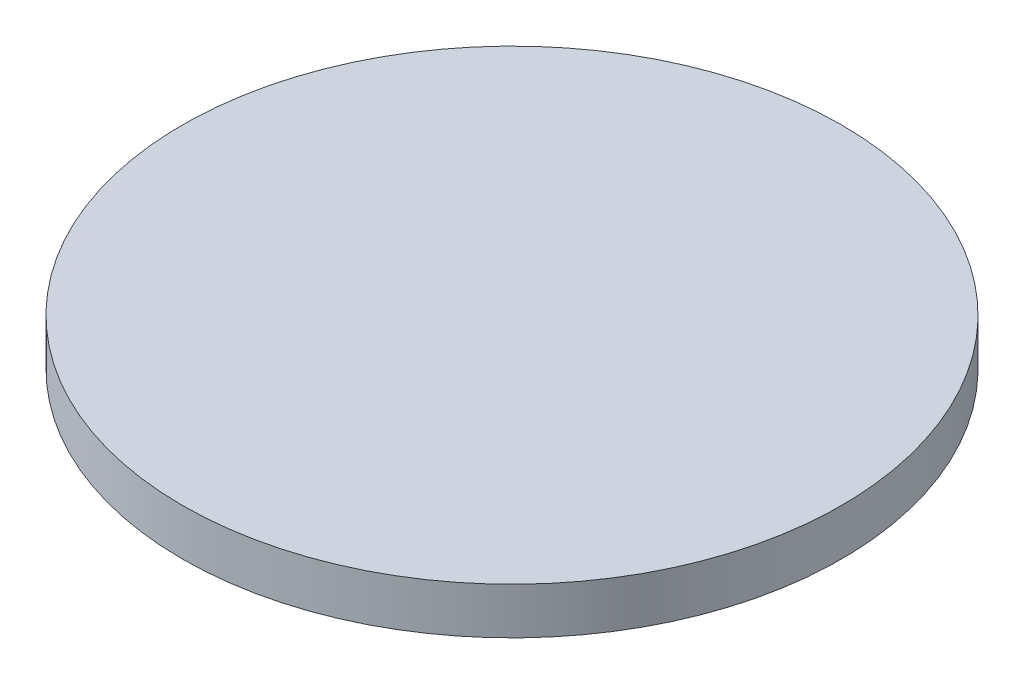
ISO-10303-21;
HEADER;
FILE_DESCRIPTION(('STEP AP214'),'2;1');
FILE_NAME('part.step','',(''),(''),'','','');
FILE_SCHEMA(('AUTOMOTIVE_DESIGN { 1 0 10303 214 1 1 1 1 }'));
ENDSEC;
DATA;
#1=APPLICATION_CONTEXT('core data for automotive mechanical design processes');
#2=APPLICATION_PROTOCOL_DEFINITION('international standard','automotive_design',2000,#1);
#3=PRODUCT_CONTEXT('',#1,'mechanical');
#4=PRODUCT('Part','Part','',(#3));
#5=PRODUCT_RELATED_PRODUCT_CATEGORY('part','',(#4));
#6=PRODUCT_DEFINITION_FORMATION('','',#4);
#7=PRODUCT_DEFINITION_CONTEXT('part definition',#1,'design');
#8=PRODUCT_DEFINITION('design','',#6,#7);
#9=PRODUCT_DEFINITION_SHAPE('','',#8);
#10=(LENGTH_UNIT() NAMED_UNIT(*) SI_UNIT(.MILLI.,.METRE.));
#11=(NAMED_UNIT(*) PLANE_ANGLE_UNIT() SI_UNIT($,.RADIAN.));
#12=(NAMED_UNIT(*) SI_UNIT($,.STERADIAN.) SOLID_ANGLE_UNIT());
#13=UNCERTAINTY_MEASURE_WITH_UNIT(LENGTH_MEASURE(1.E-05),#10,'distance_accuracy_value','');
#14=(GEOMETRIC_REPRESENTATION_CONTEXT(3) GLOBAL_UNCERTAINTY_ASSIGNED_CONTEXT((#13)) GLOBAL_UNIT_ASSIGNED_CONTEXT((#10,
#11,#12)) REPRESENTATION_CONTEXT('',''));
#15=CARTESIAN_POINT('',(0.,0.,0.));
#16=DIRECTION('',(0.,0.,1.));
#17=DIRECTION('',(1.,0.,0.));
#18=AXIS2_PLACEMENT_3D('',#15,#16,#17);
#19=CARTESIAN_POINT('',(0.,16.,0.));
#20=DIRECTION('',(0.,-1.,0.));
#21=DIRECTION('',(0.,0.,-1.));
#22=AXIS2_PLACEMENT_3D('',#19,#20,#21);
#23=CYLINDRICAL_SURFACE('',#22,113.5);
#24=CARTESIAN_POINT('',(0.,16.,0.));
#25=DIRECTION('',(0.,1.,0.));
#26=DIRECTION('',(0.,0.,1.));
#27=AXIS2_PLACEMENT_3D('',#24,#25,#26);
#28=CIRCLE('',#27,113.5);
#29=CARTESIAN_POINT('',(0.,16.,113.5));
#30=VERTEX_POINT('',#29);
#31=EDGE_CURVE('E10',#30,#30,#28,.T.);
#32=ORIENTED_EDGE('',*,*,#31,.F.);
#33=EDGE_LOOP('',(#32));
#34=FACE_BOUND('',#33,.T.);
#35=CARTESIAN_POINT('',(0.,0.,0.));
#36=DIRECTION('',(0.,1.,0.));
#37=DIRECTION('',(0.,0.,1.));
#38=AXIS2_PLACEMENT_3D('',#35,#36,#37);
#39=CIRCLE('',#38,113.5);
#40=CARTESIAN_POINT('',(0.,0.,113.5));
#41=VERTEX_POINT('',#40);
#42=EDGE_CURVE('E40',#41,#41,#39,.T.);
#43=ORIENTED_EDGE('',*,*,#42,.T.);
#44=EDGE_LOOP('',(#43));
#45=FACE_BOUND('',#44,.T.);
#46=ADVANCED_FACE('F37',(#34,#45),#23,.T.);
#47=CARTESIAN_POINT('',(0.,16.,0.));
#48=DIRECTION('',(0.,1.,0.));
#49=DIRECTION('',(0.,0.,1.));
#50=AXIS2_PLACEMENT_3D('',#47,#48,#49);
#51=PLANE('',#50);
#52=ORIENTED_EDGE('',*,*,#31,.T.);
#53=EDGE_LOOP('',(#52));
#54=FACE_BOUND('',#53,.T.);
#55=ADVANCED_FACE('F54',(#54),#51,.T.);
#56=CARTESIAN_POINT('',(0.,0.,0.));
#57=DIRECTION('',(0.,1.,0.));
#58=DIRECTION('',(0.,0.,1.));
#59=AXIS2_PLACEMENT_3D('',#56,#57,#58);
#60=PLANE('',#59);
#61=ORIENTED_EDGE('',*,*,#42,.F.);
#62=EDGE_LOOP('',(#61));
#63=FACE_BOUND('',#62,.T.);
#64=ADVANCED_FACE('F52',(#63),#60,.F.);
#65=CLOSED_SHELL('',(#46,#55,#64));
#66=MANIFOLD_SOLID_BREP('B2',#65);
#67=ADVANCED_BREP_SHAPE_REPRESENTATION('',(#18,#66),#14);
#68=SHAPE_DEFINITION_REPRESENTATION(#9,#67);
ENDSEC;
END-ISO-10303-21;
